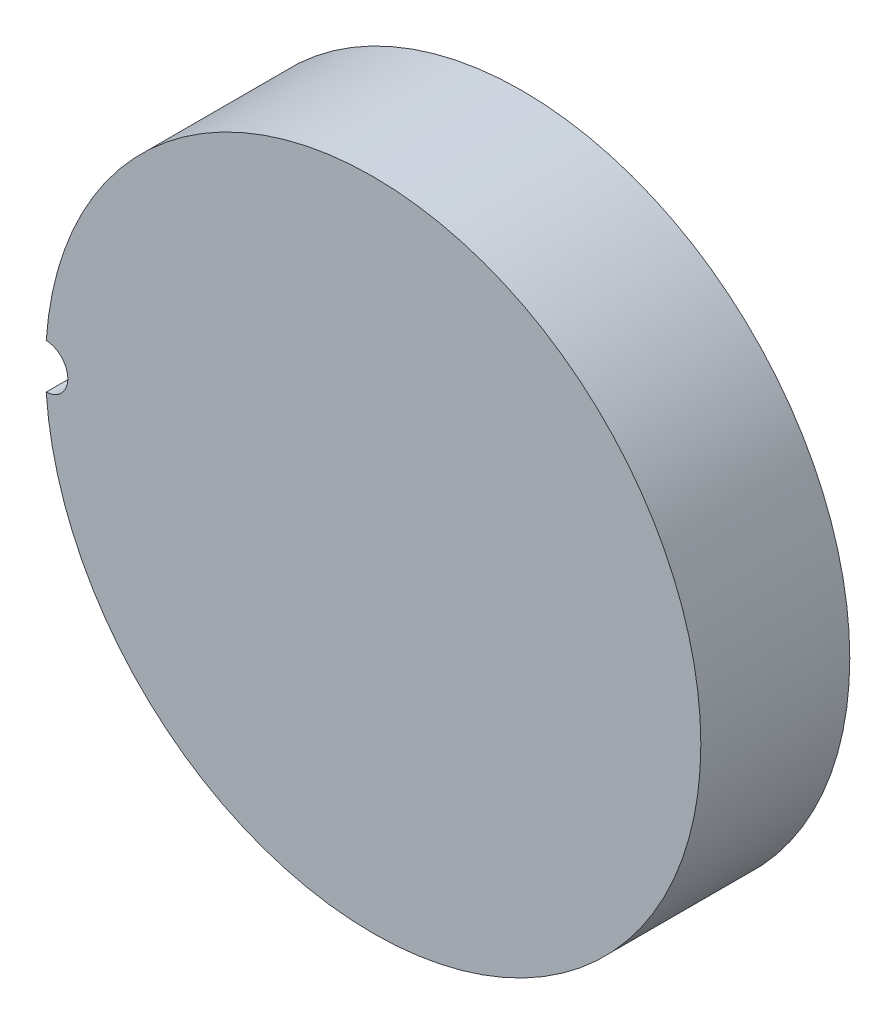
ISO-10303-21;
HEADER;
FILE_DESCRIPTION(('STEP AP214'),'2;1');
FILE_NAME('part.step','',(''),(''),'','','');
FILE_SCHEMA(('AUTOMOTIVE_DESIGN { 1 0 10303 214 1 1 1 1 }'));
ENDSEC;
DATA;
#1=APPLICATION_CONTEXT('core data for automotive mechanical design processes');
#2=APPLICATION_PROTOCOL_DEFINITION('international standard','automotive_design',2000,#1);
#3=PRODUCT_CONTEXT('',#1,'mechanical');
#4=PRODUCT('Part','Part','',(#3));
#5=PRODUCT_RELATED_PRODUCT_CATEGORY('part','',(#4));
#6=PRODUCT_DEFINITION_FORMATION('','',#4);
#7=PRODUCT_DEFINITION_CONTEXT('part definition',#1,'design');
#8=PRODUCT_DEFINITION('design','',#6,#7);
#9=PRODUCT_DEFINITION_SHAPE('','',#8);
#10=(LENGTH_UNIT() NAMED_UNIT(*) SI_UNIT(.MILLI.,.METRE.));
#11=(NAMED_UNIT(*) PLANE_ANGLE_UNIT() SI_UNIT($,.RADIAN.));
#12=(NAMED_UNIT(*) SI_UNIT($,.STERADIAN.) SOLID_ANGLE_UNIT());
#13=UNCERTAINTY_MEASURE_WITH_UNIT(LENGTH_MEASURE(1.E-05),#10,'distance_accuracy_value','');
#14=(GEOMETRIC_REPRESENTATION_CONTEXT(3) GLOBAL_UNCERTAINTY_ASSIGNED_CONTEXT((#13)) GLOBAL_UNIT_ASSIGNED_CONTEXT((#10,
#11,#12)) REPRESENTATION_CONTEXT('',''));
#15=CARTESIAN_POINT('',(0.,0.,0.));
#16=DIRECTION('',(0.,0.,1.));
#17=DIRECTION('',(1.,0.,0.));
#18=AXIS2_PLACEMENT_3D('',#15,#16,#17);
#19=CARTESIAN_POINT('',(0.,0.,0.));
#20=DIRECTION('',(0.,0.,1.));
#21=DIRECTION('',(1.,0.,0.));
#22=AXIS2_PLACEMENT_3D('',#19,#20,#21);
#23=PLANE('',#22);
#24=CARTESIAN_POINT('',(-22.,0.,0.));
#25=DIRECTION('',(0.,0.,1.));
#26=DIRECTION('',(1.,0.,0.));
#27=AXIS2_PLACEMENT_3D('',#24,#25,#26);
#28=CIRCLE('',#27,1.5);
#29=CARTESIAN_POINT('',(-21.9488636363636,-1.49912810403716,0.));
#30=VERTEX_POINT('',#29);
#31=CARTESIAN_POINT('',(-21.9488636363636,1.49912810403716,0.));
#32=VERTEX_POINT('',#31);
#33=EDGE_CURVE('E57',#30,#32,#28,.T.);
#34=ORIENTED_EDGE('',*,*,#33,.F.);
#35=CARTESIAN_POINT('',(0.,0.,0.));
#36=DIRECTION('',(0.,0.,1.));
#37=DIRECTION('',(1.,0.,0.));
#38=AXIS2_PLACEMENT_3D('',#35,#36,#37);
#39=CIRCLE('',#38,22.);
#40=EDGE_CURVE('E68',#30,#32,#39,.T.);
#41=ORIENTED_EDGE('',*,*,#40,.T.);
#42=EDGE_LOOP('',(#34,#41));
#43=FACE_BOUND('',#42,.T.);
#44=ADVANCED_FACE('F33',(#43),#23,.T.);
#45=CARTESIAN_POINT('',(0.,0.,28.1051177665153));
#46=DIRECTION('',(0.,0.,1.));
#47=DIRECTION('',(1.,0.,0.));
#48=AXIS2_PLACEMENT_3D('',#45,#46,#47);
#49=SPHERICAL_SURFACE('',#48,44.);
#50=CARTESIAN_POINT('',(0.,0.,-10.));
#51=DIRECTION('',(0.,0.,1.));
#52=DIRECTION('',(1.,0.,0.));
#53=AXIS2_PLACEMENT_3D('',#50,#51,#52);
#54=CIRCLE('',#53,22.);
#55=CARTESIAN_POINT('',(22.,0.,-10.));
#56=VERTEX_POINT('',#55);
#57=EDGE_CURVE('E69',#56,#56,#54,.T.);
#58=ORIENTED_EDGE('',*,*,#57,.F.);
#59=EDGE_LOOP('',(#58));
#60=FACE_BOUND('',#59,.T.);
#61=ADVANCED_FACE('F77',(#60),#49,.T.);
#62=CARTESIAN_POINT('',(0.,0.,18.6717640286547));
#63=DIRECTION('',(0.,0.,1.));
#64=DIRECTION('',(1.,0.,0.));
#65=AXIS2_PLACEMENT_3D('',#62,#63,#64);
#66=CYLINDRICAL_SURFACE('',#65,22.);
#67=DIRECTION('',(0.,0.,1.));
#68=VECTOR('',#67,1.);
#69=CARTESIAN_POINT('',(-21.9488636363636,-1.49912810403716,-2.5));
#70=LINE('',#69,#68);
#71=CARTESIAN_POINT('',(-21.9488636363636,-1.49912810403716,-5.));
#72=VERTEX_POINT('',#71);
#73=EDGE_CURVE('E11',#72,#30,#70,.T.);
#74=ORIENTED_EDGE('',*,*,#73,.F.);
#75=CARTESIAN_POINT('',(0.,0.,-5.));
#76=DIRECTION('',(0.,0.,1.));
#77=DIRECTION('',(1.,0.,0.));
#78=AXIS2_PLACEMENT_3D('',#75,#76,#77);
#79=CIRCLE('',#78,22.);
#80=CARTESIAN_POINT('',(-21.9488636363636,1.49912810403716,-5.));
#81=VERTEX_POINT('',#80);
#82=EDGE_CURVE('E50',#72,#81,#79,.F.);
#83=ORIENTED_EDGE('',*,*,#82,.T.);
#84=DIRECTION('',(0.,0.,1.));
#85=VECTOR('',#84,1.);
#86=CARTESIAN_POINT('',(-21.9488636363636,1.49912810403716,-2.5));
#87=LINE('',#86,#85);
#88=EDGE_CURVE('E40',#32,#81,#87,.F.);
#89=ORIENTED_EDGE('',*,*,#88,.F.);
#90=ORIENTED_EDGE('',*,*,#40,.F.);
#91=EDGE_LOOP('',(#74,#83,#89,#90));
#92=FACE_BOUND('',#91,.T.);
#93=ORIENTED_EDGE('',*,*,#57,.T.);
#94=EDGE_LOOP('',(#93));
#95=FACE_BOUND('',#94,.T.);
#96=ADVANCED_FACE('F66',(#92,#95),#66,.T.);
#97=CARTESIAN_POINT('',(-22.,0.,-5.));
#98=DIRECTION('',(0.,0.,1.));
#99=DIRECTION('',(1.,0.,0.));
#100=AXIS2_PLACEMENT_3D('',#97,#98,#99);
#101=CYLINDRICAL_SURFACE('',#100,1.5);
#102=ORIENTED_EDGE('',*,*,#73,.T.);
#103=ORIENTED_EDGE('',*,*,#33,.T.);
#104=ORIENTED_EDGE('',*,*,#88,.T.);
#105=CARTESIAN_POINT('',(-22.,0.,-5.));
#106=DIRECTION('',(0.,0.,1.));
#107=DIRECTION('',(1.,0.,0.));
#108=AXIS2_PLACEMENT_3D('',#105,#106,#107);
#109=CIRCLE('',#108,1.5);
#110=EDGE_CURVE('E46',#72,#81,#109,.T.);
#111=ORIENTED_EDGE('',*,*,#110,.F.);
#112=EDGE_LOOP('',(#102,#103,#104,#111));
#113=FACE_BOUND('',#112,.T.);
#114=ADVANCED_FACE('F59',(#113),#101,.F.);
#115=CARTESIAN_POINT('',(-22.,0.,-5.));
#116=DIRECTION('',(0.,0.,1.));
#117=DIRECTION('',(1.,0.,0.));
#118=AXIS2_PLACEMENT_3D('',#115,#116,#117);
#119=PLANE('',#118);
#120=ORIENTED_EDGE('',*,*,#110,.T.);
#121=ORIENTED_EDGE('',*,*,#82,.F.);
#122=EDGE_LOOP('',(#120,#121));
#123=FACE_BOUND('',#122,.T.);
#124=ADVANCED_FACE('F87',(#123),#119,.T.);
#125=CLOSED_SHELL('',(#44,#61,#96,#114,#124));
#126=MANIFOLD_SOLID_BREP('B2',#125);
#127=ADVANCED_BREP_SHAPE_REPRESENTATION('',(#18,#126),#14);
#128=SHAPE_DEFINITION_REPRESENTATION(#9,#127);
ENDSEC;
END-ISO-10303-21;
